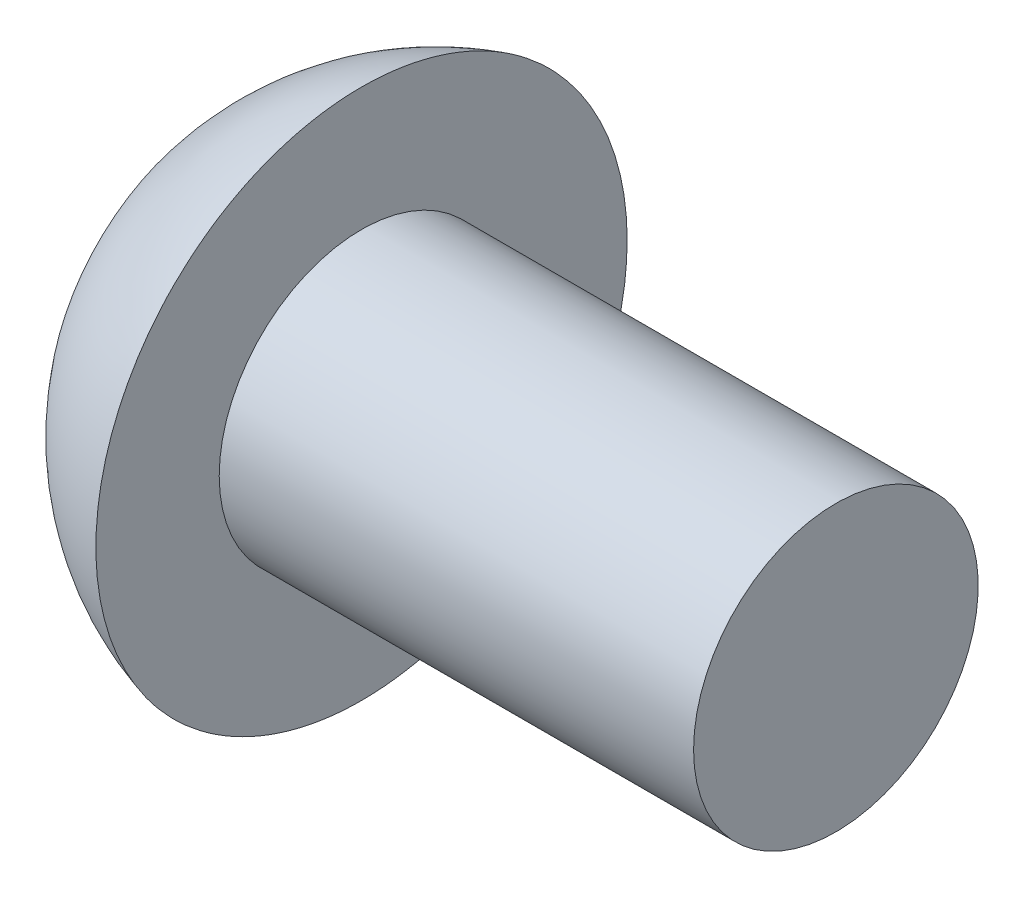
ISO-10303-21;
HEADER;
FILE_DESCRIPTION(('STEP AP214'),'2;1');
FILE_NAME('part.step','',(''),(''),'','','');
FILE_SCHEMA(('AUTOMOTIVE_DESIGN { 1 0 10303 214 1 1 1 1 }'));
ENDSEC;
DATA;
#1=APPLICATION_CONTEXT('core data for automotive mechanical design processes');
#2=APPLICATION_PROTOCOL_DEFINITION('international standard','automotive_design',2000,#1);
#3=PRODUCT_CONTEXT('',#1,'mechanical');
#4=PRODUCT('Part','Part','',(#3));
#5=PRODUCT_RELATED_PRODUCT_CATEGORY('part','',(#4));
#6=PRODUCT_DEFINITION_FORMATION('','',#4);
#7=PRODUCT_DEFINITION_CONTEXT('part definition',#1,'design');
#8=PRODUCT_DEFINITION('design','',#6,#7);
#9=PRODUCT_DEFINITION_SHAPE('','',#8);
#10=(LENGTH_UNIT() NAMED_UNIT(*) SI_UNIT(.MILLI.,.METRE.));
#11=(NAMED_UNIT(*) PLANE_ANGLE_UNIT() SI_UNIT($,.RADIAN.));
#12=(NAMED_UNIT(*) SI_UNIT($,.STERADIAN.) SOLID_ANGLE_UNIT());
#13=UNCERTAINTY_MEASURE_WITH_UNIT(LENGTH_MEASURE(1.E-05),#10,'distance_accuracy_value','');
#14=(GEOMETRIC_REPRESENTATION_CONTEXT(3) GLOBAL_UNCERTAINTY_ASSIGNED_CONTEXT((#13)) GLOBAL_UNIT_ASSIGNED_CONTEXT((#10,
#11,#12)) REPRESENTATION_CONTEXT('',''));
#15=CARTESIAN_POINT('',(0.,0.,0.));
#16=DIRECTION('',(0.,0.,1.));
#17=DIRECTION('',(1.,0.,0.));
#18=AXIS2_PLACEMENT_3D('',#15,#16,#17);
#19=CARTESIAN_POINT('',(1.3,0.,0.));
#20=DIRECTION('',(-1.,0.,0.));
#21=DIRECTION('',(0.,0.,1.));
#22=AXIS2_PLACEMENT_3D('',#19,#20,#21);
#23=PLANE('',#22);
#24=DIRECTION('',(0.,0.866025403784439,-0.5));
#25=VECTOR('',#24,1.);
#26=CARTESIAN_POINT('',(1.3,0.,-1.15470053837925));
#27=LINE('',#26,#25);
#28=CARTESIAN_POINT('',(1.3,0.,-1.15470053837925));
#29=VERTEX_POINT('',#28);
#30=CARTESIAN_POINT('',(1.3,-1.,-0.577350269189626));
#31=VERTEX_POINT('',#30);
#32=EDGE_CURVE('E95',#29,#31,#27,.F.);
#33=ORIENTED_EDGE('',*,*,#32,.T.);
#34=DIRECTION('',(0.,0.,-1.));
#35=VECTOR('',#34,1.);
#36=CARTESIAN_POINT('',(1.3,-1.,-0.577350269189626));
#37=LINE('',#36,#35);
#38=CARTESIAN_POINT('',(1.3,-1.,0.577350269189626));
#39=VERTEX_POINT('',#38);
#40=EDGE_CURVE('E142',#31,#39,#37,.F.);
#41=ORIENTED_EDGE('',*,*,#40,.T.);
#42=DIRECTION('',(0.,-0.866025403784439,-0.5));
#43=VECTOR('',#42,1.);
#44=CARTESIAN_POINT('',(1.3,-1.,0.577350269189626));
#45=LINE('',#44,#43);
#46=CARTESIAN_POINT('',(1.3,0.,1.15470053837925));
#47=VERTEX_POINT('',#46);
#48=EDGE_CURVE('E137',#39,#47,#45,.F.);
#49=ORIENTED_EDGE('',*,*,#48,.T.);
#50=DIRECTION('',(0.,-0.866025403784439,0.5));
#51=VECTOR('',#50,1.);
#52=CARTESIAN_POINT('',(1.3,0.,1.15470053837925));
#53=LINE('',#52,#51);
#54=CARTESIAN_POINT('',(1.3,1.,0.577350269189625));
#55=VERTEX_POINT('',#54);
#56=EDGE_CURVE('E78',#47,#55,#53,.F.);
#57=ORIENTED_EDGE('',*,*,#56,.T.);
#58=DIRECTION('',(0.,0.,1.));
#59=VECTOR('',#58,1.);
#60=CARTESIAN_POINT('',(1.3,1.,0.577350269189625));
#61=LINE('',#60,#59);
#62=CARTESIAN_POINT('',(1.3,1.,-0.577350269189626));
#63=VERTEX_POINT('',#62);
#64=EDGE_CURVE('E75',#55,#63,#61,.F.);
#65=ORIENTED_EDGE('',*,*,#64,.T.);
#66=DIRECTION('',(0.,0.866025403784439,0.5));
#67=VECTOR('',#66,1.);
#68=CARTESIAN_POINT('',(1.3,1.,-0.577350269189626));
#69=LINE('',#68,#67);
#70=EDGE_CURVE('E72',#63,#29,#69,.F.);
#71=ORIENTED_EDGE('',*,*,#70,.T.);
#72=EDGE_LOOP('',(#33,#41,#49,#57,#65,#71));
#73=FACE_BOUND('',#72,.T.);
#74=ADVANCED_FACE('F17',(#73),#23,.T.);
#75=CARTESIAN_POINT('',(1.3,1.,0.577350269189625));
#76=DIRECTION('',(0.,1.,0.));
#77=DIRECTION('',(0.,0.,1.));
#78=AXIS2_PLACEMENT_3D('',#75,#76,#77);
#79=PLANE('',#78);
#80=DIRECTION('',(1.,0.,0.));
#81=VECTOR('',#80,1.);
#82=CARTESIAN_POINT('',(1.3,1.,-0.577350269189626));
#83=LINE('',#82,#81);
#84=CARTESIAN_POINT('',(0.,1.,-0.577350269189626));
#85=VERTEX_POINT('',#84);
#86=EDGE_CURVE('E81',#85,#63,#83,.T.);
#87=ORIENTED_EDGE('',*,*,#86,.T.);
#88=ORIENTED_EDGE('',*,*,#64,.F.);
#89=DIRECTION('',(1.,0.,0.));
#90=VECTOR('',#89,1.);
#91=CARTESIAN_POINT('',(1.3,1.,0.577350269189625));
#92=LINE('',#91,#90);
#93=CARTESIAN_POINT('',(0.,1.,0.577350269189625));
#94=VERTEX_POINT('',#93);
#95=EDGE_CURVE('E132',#55,#94,#92,.F.);
#96=ORIENTED_EDGE('',*,*,#95,.T.);
#97=DIRECTION('',(0.,0.,-1.));
#98=VECTOR('',#97,1.);
#99=CARTESIAN_POINT('',(0.,1.,0.));
#100=LINE('',#99,#98);
#101=EDGE_CURVE('E86',#94,#85,#100,.T.);
#102=ORIENTED_EDGE('',*,*,#101,.T.);
#103=EDGE_LOOP('',(#87,#88,#96,#102));
#104=FACE_BOUND('',#103,.T.);
#105=ADVANCED_FACE('F84',(#104),#79,.F.);
#106=CARTESIAN_POINT('',(1.3,1.,-0.577350269189626));
#107=DIRECTION('',(0.,0.5,-0.866025403784439));
#108=DIRECTION('',(0.,0.866025403784439,0.5));
#109=AXIS2_PLACEMENT_3D('',#106,#107,#108);
#110=PLANE('',#109);
#111=DIRECTION('',(1.,0.,0.));
#112=VECTOR('',#111,1.);
#113=CARTESIAN_POINT('',(1.3,0.,-1.15470053837925));
#114=LINE('',#113,#112);
#115=CARTESIAN_POINT('',(0.,0.,-1.15470053837925));
#116=VERTEX_POINT('',#115);
#117=EDGE_CURVE('E92',#116,#29,#114,.T.);
#118=ORIENTED_EDGE('',*,*,#117,.T.);
#119=ORIENTED_EDGE('',*,*,#70,.F.);
#120=ORIENTED_EDGE('',*,*,#86,.F.);
#121=DIRECTION('',(0.,-0.866025403784439,-0.5));
#122=VECTOR('',#121,1.);
#123=CARTESIAN_POINT('',(0.,1.,-0.577350269189626));
#124=LINE('',#123,#122);
#125=EDGE_CURVE('E129',#85,#116,#124,.T.);
#126=ORIENTED_EDGE('',*,*,#125,.T.);
#127=EDGE_LOOP('',(#118,#119,#120,#126));
#128=FACE_BOUND('',#127,.T.);
#129=ADVANCED_FACE('F90',(#128),#110,.F.);
#130=CARTESIAN_POINT('',(1.3,0.,-1.15470053837925));
#131=DIRECTION('',(0.,-0.5,-0.866025403784439));
#132=DIRECTION('',(0.,0.866025403784439,-0.5));
#133=AXIS2_PLACEMENT_3D('',#130,#131,#132);
#134=PLANE('',#133);
#135=DIRECTION('',(1.,0.,0.));
#136=VECTOR('',#135,1.);
#137=CARTESIAN_POINT('',(1.3,-1.,-0.577350269189626));
#138=LINE('',#137,#136);
#139=CARTESIAN_POINT('',(0.,-1.,-0.577350269189626));
#140=VERTEX_POINT('',#139);
#141=EDGE_CURVE('E144',#140,#31,#138,.T.);
#142=ORIENTED_EDGE('',*,*,#141,.T.);
#143=ORIENTED_EDGE('',*,*,#32,.F.);
#144=ORIENTED_EDGE('',*,*,#117,.F.);
#145=DIRECTION('',(0.,-0.866025403784439,0.5));
#146=VECTOR('',#145,1.);
#147=CARTESIAN_POINT('',(0.,0.,-1.15470053837925));
#148=LINE('',#147,#146);
#149=EDGE_CURVE('E127',#116,#140,#148,.T.);
#150=ORIENTED_EDGE('',*,*,#149,.T.);
#151=EDGE_LOOP('',(#142,#143,#144,#150));
#152=FACE_BOUND('',#151,.T.);
#153=ADVANCED_FACE('F149',(#152),#134,.F.);
#154=CARTESIAN_POINT('',(1.3,-1.,-0.577350269189626));
#155=DIRECTION('',(0.,-1.,0.));
#156=DIRECTION('',(0.,0.,-1.));
#157=AXIS2_PLACEMENT_3D('',#154,#155,#156);
#158=PLANE('',#157);
#159=DIRECTION('',(1.,0.,0.));
#160=VECTOR('',#159,1.);
#161=CARTESIAN_POINT('',(1.3,-1.,0.577350269189626));
#162=LINE('',#161,#160);
#163=CARTESIAN_POINT('',(0.,-1.,0.577350269189626));
#164=VERTEX_POINT('',#163);
#165=EDGE_CURVE('E139',#164,#39,#162,.T.);
#166=ORIENTED_EDGE('',*,*,#165,.T.);
#167=ORIENTED_EDGE('',*,*,#40,.F.);
#168=ORIENTED_EDGE('',*,*,#141,.F.);
#169=DIRECTION('',(0.,0.,-1.));
#170=VECTOR('',#169,1.);
#171=CARTESIAN_POINT('',(0.,-1.,0.));
#172=LINE('',#171,#170);
#173=EDGE_CURVE('E125',#140,#164,#172,.F.);
#174=ORIENTED_EDGE('',*,*,#173,.T.);
#175=EDGE_LOOP('',(#166,#167,#168,#174));
#176=FACE_BOUND('',#175,.T.);
#177=ADVANCED_FACE('F153',(#176),#158,.F.);
#178=CARTESIAN_POINT('',(1.3,-1.,0.577350269189626));
#179=DIRECTION('',(0.,-0.5,0.866025403784439));
#180=DIRECTION('',(0.,-0.866025403784439,-0.5));
#181=AXIS2_PLACEMENT_3D('',#178,#179,#180);
#182=PLANE('',#181);
#183=DIRECTION('',(1.,0.,0.));
#184=VECTOR('',#183,1.);
#185=CARTESIAN_POINT('',(1.3,0.,1.15470053837925));
#186=LINE('',#185,#184);
#187=CARTESIAN_POINT('',(0.,0.,1.15470053837925));
#188=VERTEX_POINT('',#187);
#189=EDGE_CURVE('E135',#188,#47,#186,.T.);
#190=ORIENTED_EDGE('',*,*,#189,.T.);
#191=ORIENTED_EDGE('',*,*,#48,.F.);
#192=ORIENTED_EDGE('',*,*,#165,.F.);
#193=DIRECTION('',(0.,0.866025403784439,0.5));
#194=VECTOR('',#193,1.);
#195=CARTESIAN_POINT('',(0.,-1.,0.577350269189626));
#196=LINE('',#195,#194);
#197=EDGE_CURVE('E39',#164,#188,#196,.T.);
#198=ORIENTED_EDGE('',*,*,#197,.T.);
#199=EDGE_LOOP('',(#190,#191,#192,#198));
#200=FACE_BOUND('',#199,.T.);
#201=ADVANCED_FACE('F155',(#200),#182,.F.);
#202=CARTESIAN_POINT('',(1.3,0.,1.15470053837925));
#203=DIRECTION('',(0.,0.5,0.866025403784439));
#204=DIRECTION('',(0.,-0.866025403784439,0.5));
#205=AXIS2_PLACEMENT_3D('',#202,#203,#204);
#206=PLANE('',#205);
#207=ORIENTED_EDGE('',*,*,#95,.F.);
#208=ORIENTED_EDGE('',*,*,#56,.F.);
#209=ORIENTED_EDGE('',*,*,#189,.F.);
#210=DIRECTION('',(0.,0.866025403784438,-0.5));
#211=VECTOR('',#210,1.);
#212=CARTESIAN_POINT('',(0.,0.,1.15470053837925));
#213=LINE('',#212,#211);
#214=EDGE_CURVE('E121',#188,#94,#213,.T.);
#215=ORIENTED_EDGE('',*,*,#214,.T.);
#216=EDGE_LOOP('',(#207,#208,#209,#215));
#217=FACE_BOUND('',#216,.T.);
#218=ADVANCED_FACE('F158',(#217),#206,.F.);
#219=CARTESIAN_POINT('',(0.,0.,0.));
#220=DIRECTION('',(1.,0.,0.));
#221=DIRECTION('',(0.,0.,-1.));
#222=AXIS2_PLACEMENT_3D('',#219,#220,#221);
#223=PLANE('',#222);
#224=CARTESIAN_POINT('',(0.,-1.8,0.));
#225=CARTESIAN_POINT('',(0.,-1.79999969693813,-0.0505383553463636));
#226=CARTESIAN_POINT('',(0.,-1.79786965821117,-0.101085998847833));
#227=CARTESIAN_POINT('',(0.,-1.78936335708246,-0.201831968349741));
#228=CARTESIAN_POINT('',(1.51071546462001E-13,-1.78298584106246,-0.252030186798318));
#229=CARTESIAN_POINT('',(-1.51311933718999E-13,-1.76601326021542,-0.35179543440894));
#230=CARTESIAN_POINT('',(-5.6574903691244E-13,-1.7554115005106,-0.401361332113267));
#231=CARTESIAN_POINT('',(5.66209102950636E-13,-1.73006357821317,-0.4994513470748));
#232=CARTESIAN_POINT('',(2.11419916519631E-12,-1.7153140524109,-0.547974584380645));
#233=CARTESIAN_POINT('',(3.7989553682124E-12,-1.66504737561974,-0.691252996354969));
#234=CARTESIAN_POINT('',(9.97957659202798E-13,-1.62347083872426,-0.783957995374269));
#235=CARTESIAN_POINT('',(-9.97995599810074E-13,-1.5253242715079,-0.961060444041289));
#236=CARTESIAN_POINT('',(-1.92814050339862E-13,-1.46875367122068,-1.0454575777165));
#237=CARTESIAN_POINT('',(0.,-1.37393237862705,-1.1639935576829));
#238=CARTESIAN_POINT('',(0.,-1.34063934533778,-1.20218459533929));
#239=CARTESIAN_POINT('',(0.,-1.27099181665424,-1.27559317409802));
#240=CARTESIAN_POINT('',(0.,-1.2346403039193,-1.31081354659702));
#241=CARTESIAN_POINT('',(1.49397313255741E-13,-1.12128865477494,-1.41171053074979));
#242=CARTESIAN_POINT('',(7.2255174093582E-13,-1.03997085608677,-1.47264864886824));
#243=CARTESIAN_POINT('',(7.20738225274102E-13,-0.868302977752408,-1.57997169667932));
#244=CARTESIAN_POINT('',(1.45813580276399E-13,-0.777953238856439,-1.62635717512994));
#245=CARTESIAN_POINT('',(-1.45812022887226E-13,-0.590738654674472,-1.70330985037171));
#246=CARTESIAN_POINT('',(1.37477852594083E-13,-0.493873878984592,-1.73387721610768));
#247=CARTESIAN_POINT('',(2.30283772122708E-13,-0.296389602022536,-1.77831350061168));
#248=CARTESIAN_POINT('',(0.,-0.195770080701387,-1.79218233020245));
#249=CARTESIAN_POINT('',(0.,0.00636923610669175,-1.80283190065489));
#250=CARTESIAN_POINT('',(0.,0.10788903159362,-1.79961264151658));
#251=CARTESIAN_POINT('',(0.,0.308949283786903,-1.77617340058004));
#252=CARTESIAN_POINT('',(0.,0.408489751060768,-1.75595350957209));
#253=CARTESIAN_POINT('',(0.,0.602753886185803,-1.69909877747923));
#254=CARTESIAN_POINT('',(0.,0.69747750257834,-1.6624637610718));
#255=CARTESIAN_POINT('',(0.,0.879472223548245,-1.5737731833174));
#256=CARTESIAN_POINT('',(0.,0.96674304692356,-1.52171704044529));
#257=CARTESIAN_POINT('',(0.,1.09006914068348,-1.43328925989624));
#258=CARTESIAN_POINT('',(0.,1.12992026465015,-1.40208357074052));
#259=CARTESIAN_POINT('',(0.,1.20689578170788,-1.33639972599312));
#260=CARTESIAN_POINT('',(0.,1.24401750616591,-1.30191844127035));
#261=CARTESIAN_POINT('',(1.43656520355628E-13,1.35076927785449,-1.19400219913293));
#262=CARTESIAN_POINT('',(0.,1.41589490317864,-1.11601654714749));
#263=CARTESIAN_POINT('',(0.,1.53210752784414,-0.950207464620376));
#264=CARTESIAN_POINT('',(0.,1.58319506079509,-0.86238440819234));
#265=CARTESIAN_POINT('',(0.,1.64823872656556,-0.725181042064781));
#266=CARTESIAN_POINT('',(0.,1.66800527485629,-0.67847626031049));
#267=CARTESIAN_POINT('',(0.,1.70351987444946,-0.583592745326409));
#268=CARTESIAN_POINT('',(0.,1.71927117788053,-0.535415240572516));
#269=CARTESIAN_POINT('',(0.,1.74663282949914,-0.437985711413424));
#270=CARTESIAN_POINT('',(0.,1.75824971661208,-0.388735515679737));
#271=CARTESIAN_POINT('',(0.,1.77729500833267,-0.289441082839439));
#272=CARTESIAN_POINT('',(0.,1.78472464831743,-0.239397084415694));
#273=CARTESIAN_POINT('',(0.,1.79335428483933,-0.157729601792055));
#274=CARTESIAN_POINT('',(0.,1.79584563928913,-0.126236872827486));
#275=CARTESIAN_POINT('',(0.,1.79916859156829,-0.0631639717658366));
#276=CARTESIAN_POINT('',(0.,1.80000018939764,-0.0315837996687572));
#277=CARTESIAN_POINT('',(0.,1.79999969693813,0.0505383553463631));
#278=CARTESIAN_POINT('',(0.,1.79786965821117,0.101085998847833));
#279=CARTESIAN_POINT('',(0.,1.78936335708246,0.201831968349741));
#280=CARTESIAN_POINT('',(1.51230046268288E-13,1.78298584106246,0.252030186798317));
#281=CARTESIAN_POINT('',(-1.51470685732498E-13,1.76601326021542,0.35179543440894));
#282=CARTESIAN_POINT('',(-5.65748370397587E-13,1.7554115005106,0.401361332113267));
#283=CARTESIAN_POINT('',(5.66208435893774E-13,1.73006357821317,0.4994513470748));
#284=CARTESIAN_POINT('',(2.11403748557181E-12,1.7153140524109,0.547974584380644));
#285=CARTESIAN_POINT('',(3.79927795675373E-12,1.66504737561974,0.691252996354969));
#286=CARTESIAN_POINT('',(9.99887459444341E-13,1.62347083872427,0.783957995374269));
#287=CARTESIAN_POINT('',(-9.99925473419254E-13,1.5253242715079,0.961060444041288));
#288=CARTESIAN_POINT('',(-2.00211078447118E-13,1.46875367122068,1.04545757771649));
#289=CARTESIAN_POINT('',(0.,1.37393237862705,1.1639935576829));
#290=CARTESIAN_POINT('',(0.,1.34063934533778,1.20218459533929));
#291=CARTESIAN_POINT('',(0.,1.27099181665424,1.27559317409802));
#292=CARTESIAN_POINT('',(0.,1.2346403039193,1.31081354659702));
#293=CARTESIAN_POINT('',(1.48899528940263E-13,1.12128865477494,1.41171053074979));
#294=CARTESIAN_POINT('',(7.23912342890468E-13,1.03997085608677,1.47264864886824));
#295=CARTESIAN_POINT('',(7.22847056162156E-13,0.868302977752408,1.57997169667932));
#296=CARTESIAN_POINT('',(1.46812365777827E-13,0.777953238856439,1.62635717512994));
#297=CARTESIAN_POINT('',(-1.46810797720938E-13,0.590738654674473,1.70330985037171));
#298=CARTESIAN_POINT('',(1.35591560435206E-13,0.493873878984592,1.73387721610768));
#299=CARTESIAN_POINT('',(2.28700618139069E-13,0.296389602022537,1.77831350061168));
#300=CARTESIAN_POINT('',(0.,0.195770080701387,1.79218233020245));
#301=CARTESIAN_POINT('',(0.,-0.00636923610669051,1.8028319006549));
#302=CARTESIAN_POINT('',(0.,-0.107889031593619,1.79961264151658));
#303=CARTESIAN_POINT('',(0.,-0.308949283786901,1.77617340058004));
#304=CARTESIAN_POINT('',(0.,-0.408489751060766,1.75595350957209));
#305=CARTESIAN_POINT('',(0.,-0.602753886185801,1.69909877747923));
#306=CARTESIAN_POINT('',(0.,-0.697477502578339,1.6624637610718));
#307=CARTESIAN_POINT('',(0.,-0.879472223548244,1.5737731833174));
#308=CARTESIAN_POINT('',(0.,-0.966743046923559,1.52171704044529));
#309=CARTESIAN_POINT('',(0.,-1.09006914068348,1.43328925989624));
#310=CARTESIAN_POINT('',(0.,-1.12992026465015,1.40208357074052));
#311=CARTESIAN_POINT('',(0.,-1.20689578170787,1.33639972599313));
#312=CARTESIAN_POINT('',(0.,-1.24401750616591,1.30191844127035));
#313=CARTESIAN_POINT('',(1.43684743749562E-13,-1.35076927785449,1.19400219913293));
#314=CARTESIAN_POINT('',(0.,-1.41589490317864,1.11601654714749));
#315=CARTESIAN_POINT('',(0.,-1.53210752784414,0.950207464620378));
#316=CARTESIAN_POINT('',(0.,-1.58319506079509,0.862384408192342));
#317=CARTESIAN_POINT('',(0.,-1.64823872656556,0.725181042064782));
#318=CARTESIAN_POINT('',(0.,-1.66800527485629,0.678476260310492));
#319=CARTESIAN_POINT('',(0.,-1.70351987444946,0.58359274532641));
#320=CARTESIAN_POINT('',(0.,-1.71927117788053,0.535415240572518));
#321=CARTESIAN_POINT('',(0.,-1.74663282949914,0.437985711413426));
#322=CARTESIAN_POINT('',(0.,-1.75824971661208,0.388735515679738));
#323=CARTESIAN_POINT('',(0.,-1.77729500833267,0.28944108283944));
#324=CARTESIAN_POINT('',(0.,-1.78472464831743,0.239397084415696));
#325=CARTESIAN_POINT('',(0.,-1.79335428483933,0.157729601792057));
#326=CARTESIAN_POINT('',(0.,-1.79584563928913,0.126236872827486));
#327=CARTESIAN_POINT('',(0.,-1.79916859156829,0.0631639717658366));
#328=CARTESIAN_POINT('',(0.,-1.80000018939764,0.031583799668757));
#329=CARTESIAN_POINT('',(0.,-1.8,0.));
#330=B_SPLINE_CURVE_WITH_KNOTS('',3,(#224,#225,#226,#227,#228,#229,#230,#231,#232,#233,#234,
#235,#236,#237,#238,#239,#240,#241,#242,#243,#244,#245,#246,#247,#248,#249,#250,#251,#252,#253,
#254,#255,#256,#257,#258,#259,#260,#261,#262,#263,#264,#265,#266,#267,#268,#269,#270,#271,#272,
#273,#274,#275,#276,#277,#278,#279,#280,#281,#282,#283,#284,#285,#286,#287,#288,#289,#290,#291,
#292,#293,#294,#295,#296,#297,#298,#299,#300,#301,#302,#303,#304,#305,#306,#307,#308,#309,#310,
#311,#312,#313,#314,#315,#316,#317,#318,#319,#320,#321,#322,#323,#324,#325,#326,#327,#328,#329),
.UNSPECIFIED.,.T.,.F.,(4,2,2,2,2,2,2,2,2,2,2,2,2,2,2,2,2,2,2,2,2,2,2,2,2,2,2,2,2,2,2,2,2,2,2,2,
2,2,2,2,2,2,2,2,2,2,2,2,2,2,2,2,4),(0.,0.151585989710196,0.303216738983041,0.455088765324585,
0.6070842937084,0.910350805750165,1.21362884745506,1.36546657207417,1.51715790225758,
1.82044323652332,2.12371713298388,2.42698779027096,2.73026006714468,3.03353234401834,
3.33680300130515,3.6400768977656,3.94336223203168,4.09505356221516,4.24689128683427,
4.55016932853894,4.8534358405808,5.00543136896507,5.15730339530697,5.30893414458,
5.46052013429044,5.55525336212866,5.64998658996691,5.8015725796771,5.95320332894995,
6.10507535529149,6.25707088367531,6.56033739571707,6.86361543742197,7.01545316204107,
7.16714449222448,7.47042982649022,7.77370372295079,8.07697438023786,8.38024665711158,
8.68351893398524,8.98678959127205,9.29006348773251,9.59334882199858,9.74504015218206,
9.89687787680118,10.2001559185058,10.5034224305477,10.655417958932,10.8072899852739,
10.9589207345469,11.1105067242574,11.2052399520956,11.2999731799338),.UNSPECIFIED.);
#331=CARTESIAN_POINT('',(0.,-1.8,0.));
#332=VERTEX_POINT('',#331);
#333=EDGE_CURVE('E20',#332,#332,#330,.T.);
#334=ORIENTED_EDGE('',*,*,#333,.F.);
#335=EDGE_LOOP('',(#334));
#336=FACE_BOUND('',#335,.T.);
#337=ORIENTED_EDGE('',*,*,#197,.F.);
#338=ORIENTED_EDGE('',*,*,#173,.F.);
#339=ORIENTED_EDGE('',*,*,#149,.F.);
#340=ORIENTED_EDGE('',*,*,#125,.F.);
#341=ORIENTED_EDGE('',*,*,#101,.F.);
#342=ORIENTED_EDGE('',*,*,#214,.F.);
#343=EDGE_LOOP('',(#337,#338,#339,#340,#341,#342));
#344=FACE_BOUND('',#343,.T.);
#345=ADVANCED_FACE('F114',(#336,#344),#223,.F.);
#346=CARTESIAN_POINT('',(2.28333333333333,0.,0.));
#347=DIRECTION('',(0.,1.,0.));
#348=DIRECTION('',(1.,0.,0.));
#349=AXIS2_PLACEMENT_3D('',#346,#347,#348);
#350=SPHERICAL_SURFACE('',#349,2.90750943439761);
#351=ORIENTED_EDGE('',*,*,#333,.T.);
#352=EDGE_LOOP('',(#351));
#353=FACE_BOUND('',#352,.T.);
#354=CARTESIAN_POINT('',(1.5,2.8,0.));
#355=CARTESIAN_POINT('',(1.5,2.80000058114663,-0.097602902906246));
#356=CARTESIAN_POINT('',(1.5,2.79489033321137,-0.195197225793099));
#357=CARTESIAN_POINT('',(1.5,2.77451565330272,-0.389368402876138));
#358=CARTESIAN_POINT('',(1.5,2.75924432689463,-0.485944520978123));
#359=CARTESIAN_POINT('',(1.5,2.70627858731672,-0.735356657485282));
#360=CARTESIAN_POINT('',(1.5,2.66058825775473,-0.886570466076757));
#361=CARTESIAN_POINT('',(1.5,2.54443496530946,-1.17927883826553));
#362=CARTESIAN_POINT('',(1.5,2.47394598727788,-1.32076300787352));
#363=CARTESIAN_POINT('',(1.5,2.31023409393156,-1.5898419060271));
#364=CARTESIAN_POINT('',(1.5,2.21702056371508,-1.71744233708582));
#365=CARTESIAN_POINT('',(1.5,2.01051665662983,-1.95514926157889));
#366=CARTESIAN_POINT('',(1.5,1.89723083380139,-2.06525971244938));
#367=CARTESIAN_POINT('',(1.5,1.65377108245464,-2.26491180732828));
#368=CARTESIAN_POINT('',(1.5,1.52359556754626,-2.35445151700685));
#369=CARTESIAN_POINT('',(1.5,1.2500547452375,-2.51040859878638));
#370=CARTESIAN_POINT('',(1.5,1.1066889282367,-2.57682507705875));
#371=CARTESIAN_POINT('',(1.5,0.810844291441427,-2.68464490303648));
#372=CARTESIAN_POINT('',(1.5,0.6583656348651,-2.72604869859128));
#373=CARTESIAN_POINT('',(1.5,0.348621867363058,-2.78266949830994));
#374=CARTESIAN_POINT('',(1.5,0.191356770024623,-2.79788657680303));
#375=CARTESIAN_POINT('',(1.5,-0.123496096015708,-2.80170224104092));
#376=CARTESIAN_POINT('',(1.5,-0.281083864890645,-2.79030081250716));
#377=CARTESIAN_POINT('',(1.5,-0.592108819054531,-2.74120301008156));
#378=CARTESIAN_POINT('',(1.5,-0.745545997014651,-2.70350658976297));
#379=CARTESIAN_POINT('',(1.5,-1.04391584692778,-2.6028882607058));
#380=CARTESIAN_POINT('',(1.5,-1.18884840460742,-2.53996601310625));
#381=CARTESIAN_POINT('',(1.5,-1.46608850320062,-2.39068404738938));
#382=CARTESIAN_POINT('',(1.5,-1.59839640547873,-2.30432500039254));
#383=CARTESIAN_POINT('',(1.5,-1.84662736593538,-2.11062813801582));
#384=CARTESIAN_POINT('',(1.5,-1.96255156458538,-2.00329178410926));
#385=CARTESIAN_POINT('',(1.5,-2.1747542244558,-1.77065850816234));
#386=CARTESIAN_POINT('',(1.5,-2.27102938322741,-1.64535857296605));
#387=CARTESIAN_POINT('',(1.5,-2.44120016914855,-1.38034674222735));
#388=CARTESIAN_POINT('',(1.5,-2.51508899178783,-1.24063048198967));
#389=CARTESIAN_POINT('',(1.5,-2.63830716797482,-0.950832062564711));
#390=CARTESIAN_POINT('',(1.5,-2.68765551021545,-0.800758020642758));
#391=CARTESIAN_POINT('',(1.5,-2.74927114196675,-0.54167924182637));
#392=CARTESIAN_POINT('',(1.5,-2.7682728701565,-0.434222541732076));
#393=CARTESIAN_POINT('',(1.5,-2.79363458299388,-0.217839951954246));
#394=CARTESIAN_POINT('',(1.5,-2.79999935150113,-0.108914633959985));
#395=CARTESIAN_POINT('',(1.5,-2.80000058114663,0.0976029029062455));
#396=CARTESIAN_POINT('',(1.5,-2.79489033321137,0.195197225793099));
#397=CARTESIAN_POINT('',(1.5,-2.77451565330272,0.389368402876137));
#398=CARTESIAN_POINT('',(1.5,-2.75924432689463,0.485944520978123));
#399=CARTESIAN_POINT('',(1.5,-2.70627858731672,0.735356657485282));
#400=CARTESIAN_POINT('',(1.5,-2.66058825775473,0.886570466076757));
#401=CARTESIAN_POINT('',(1.5,-2.54443496530946,1.17927883826553));
#402=CARTESIAN_POINT('',(1.5,-2.47394598727788,1.32076300787352));
#403=CARTESIAN_POINT('',(1.5,-2.31023409393156,1.5898419060271));
#404=CARTESIAN_POINT('',(1.5,-2.21702056371508,1.71744233708582));
#405=CARTESIAN_POINT('',(1.5,-2.01051665662983,1.95514926157889));
#406=CARTESIAN_POINT('',(1.5,-1.89723083380139,2.06525971244938));
#407=CARTESIAN_POINT('',(1.5,-1.65377108245464,2.26491180732828));
#408=CARTESIAN_POINT('',(1.5,-1.52359556754626,2.35445151700685));
#409=CARTESIAN_POINT('',(1.5,-1.2500547452375,2.51040859878638));
#410=CARTESIAN_POINT('',(1.5,-1.1066889282367,2.57682507705875));
#411=CARTESIAN_POINT('',(1.5,-0.810844291441426,2.68464490303648));
#412=CARTESIAN_POINT('',(1.5,-0.6583656348651,2.72604869859128));
#413=CARTESIAN_POINT('',(1.5,-0.348621867363058,2.78266949830994));
#414=CARTESIAN_POINT('',(1.5,-0.191356770024623,2.79788657680303));
#415=CARTESIAN_POINT('',(1.5,0.123496096015708,2.80170224104092));
#416=CARTESIAN_POINT('',(1.5,0.281083864890644,2.79030081250716));
#417=CARTESIAN_POINT('',(1.5,0.592108819054531,2.74120301008156));
#418=CARTESIAN_POINT('',(1.5,0.745545997014651,2.70350658976297));
#419=CARTESIAN_POINT('',(1.5,1.04391584692778,2.6028882607058));
#420=CARTESIAN_POINT('',(1.5,1.18884840460742,2.53996601310625));
#421=CARTESIAN_POINT('',(1.5,1.46608850320062,2.39068404738938));
#422=CARTESIAN_POINT('',(1.5,1.59839640547873,2.30432500039254));
#423=CARTESIAN_POINT('',(1.5,1.84662736593538,2.11062813801582));
#424=CARTESIAN_POINT('',(1.5,1.96255156458538,2.00329178410926));
#425=CARTESIAN_POINT('',(1.5,2.1747542244558,1.77065850816235));
#426=CARTESIAN_POINT('',(1.5,2.27102938322741,1.64535857296605));
#427=CARTESIAN_POINT('',(1.5,2.44120016914855,1.38034674222735));
#428=CARTESIAN_POINT('',(1.5,2.51508899178783,1.24063048198967));
#429=CARTESIAN_POINT('',(1.5,2.63830716797482,0.950832062564712));
#430=CARTESIAN_POINT('',(1.5,2.68765551021545,0.800758020642758));
#431=CARTESIAN_POINT('',(1.5,2.74927114196675,0.54167924182637));
#432=CARTESIAN_POINT('',(1.5,2.7682728701565,0.434222541732076));
#433=CARTESIAN_POINT('',(1.5,2.79363458299388,0.217839951954245));
#434=CARTESIAN_POINT('',(1.5,2.79999935150113,0.108914633959985));
#435=CARTESIAN_POINT('',(1.5,2.8,0.));
#436=B_SPLINE_CURVE_WITH_KNOTS('',3,(#354,#355,#356,#357,#358,#359,#360,#361,#362,#363,#364,
#365,#366,#367,#368,#369,#370,#371,#372,#373,#374,#375,#376,#377,#378,#379,#380,#381,#382,#383,
#384,#385,#386,#387,#388,#389,#390,#391,#392,#393,#394,#395,#396,#397,#398,#399,#400,#401,#402,
#403,#404,#405,#406,#407,#408,#409,#410,#411,#412,#413,#414,#415,#416,#417,#418,#419,#420,#421,
#422,#423,#424,#425,#426,#427,#428,#429,#430,#431,#432,#433,#434,#435),.UNSPECIFIED.,.T.,.F.,(4,
2,2,2,2,2,2,2,2,2,2,2,2,2,2,2,2,2,2,2,2,2,2,2,2,2,2,2,2,2,2,2,2,2,2,2,2,2,2,2,4),(0.,
0.292649740000539,0.58549824973262,1.05700706396217,1.52901199916255,2.00082232852149,
2.47252574939804,2.94427350785476,3.41603949969872,3.88779704437215,4.35955324999121,
4.83130970866732,5.30306700028442,5.77483062927493,6.24658075058338,6.71829801712137,
7.19009450084165,7.66203424742665,8.13360825067272,8.46029845584223,8.78686496525497,
9.07951470525551,9.37236321498759,9.84387202921714,10.3158769644175,10.7876872937765,
11.259390714653,11.7311384731097,12.2029044649537,12.6746620096271,13.1464182152462,
13.6181746739223,14.0899319655394,14.5616955945299,15.0334457158384,15.5051629823763,
15.9769594660966,16.4488992126816,16.9204732159277,17.2471634210972,17.5737299305099),.UNSPECIFIED.);
#437=CARTESIAN_POINT('',(1.5,2.8,0.));
#438=VERTEX_POINT('',#437);
#439=EDGE_CURVE('E100',#438,#438,#436,.T.);
#440=ORIENTED_EDGE('',*,*,#439,.T.);
#441=EDGE_LOOP('',(#440));
#442=FACE_BOUND('',#441,.T.);
#443=ADVANCED_FACE('F109',(#353,#442),#350,.T.);
#444=CARTESIAN_POINT('',(6.5,0.,0.));
#445=DIRECTION('',(-1.,0.,0.));
#446=DIRECTION('',(0.,0.,1.));
#447=AXIS2_PLACEMENT_3D('',#444,#445,#446);
#448=PLANE('',#447);
#449=CARTESIAN_POINT('',(6.5,0.,0.));
#450=DIRECTION('',(-1.,0.,0.));
#451=DIRECTION('',(0.,0.,1.));
#452=AXIS2_PLACEMENT_3D('',#449,#450,#451);
#453=CIRCLE('',#452,1.5);
#454=CARTESIAN_POINT('',(6.5,0.,1.5));
#455=VERTEX_POINT('',#454);
#456=EDGE_CURVE('E30',#455,#455,#453,.T.);
#457=ORIENTED_EDGE('',*,*,#456,.F.);
#458=EDGE_LOOP('',(#457));
#459=FACE_BOUND('',#458,.T.);
#460=ADVANCED_FACE('F113',(#459),#448,.F.);
#461=CARTESIAN_POINT('',(1.5,1.5,0.));
#462=DIRECTION('',(-1.,0.,0.));
#463=DIRECTION('',(0.,0.,1.));
#464=AXIS2_PLACEMENT_3D('',#461,#462,#463);
#465=PLANE('',#464);
#466=CARTESIAN_POINT('',(1.5,0.,0.));
#467=DIRECTION('',(-1.,0.,0.));
#468=DIRECTION('',(0.,0.,1.));
#469=AXIS2_PLACEMENT_3D('',#466,#467,#468);
#470=CIRCLE('',#469,1.5);
#471=CARTESIAN_POINT('',(1.5,0.,1.5));
#472=VERTEX_POINT('',#471);
#473=EDGE_CURVE('E11',#472,#472,#470,.F.);
#474=ORIENTED_EDGE('',*,*,#473,.F.);
#475=EDGE_LOOP('',(#474));
#476=FACE_BOUND('',#475,.T.);
#477=ORIENTED_EDGE('',*,*,#439,.F.);
#478=EDGE_LOOP('',(#477));
#479=FACE_BOUND('',#478,.T.);
#480=ADVANCED_FACE('F105',(#476,#479),#465,.F.);
#481=CARTESIAN_POINT('',(-16.5029441624365,0.,0.));
#482=DIRECTION('',(-1.,0.,0.));
#483=DIRECTION('',(0.,0.,1.));
#484=AXIS2_PLACEMENT_3D('',#481,#482,#483);
#485=CYLINDRICAL_SURFACE('',#484,1.5);
#486=ORIENTED_EDGE('',*,*,#473,.T.);
#487=EDGE_LOOP('',(#486));
#488=FACE_BOUND('',#487,.T.);
#489=ORIENTED_EDGE('',*,*,#456,.T.);
#490=EDGE_LOOP('',(#489));
#491=FACE_BOUND('',#490,.T.);
#492=ADVANCED_FACE('F167',(#488,#491),#485,.T.);
#493=CLOSED_SHELL('',(#74,#105,#129,#153,#177,#201,#218,#345,#443,#460,#480,#492));
#494=MANIFOLD_SOLID_BREP('B1',#493);
#495=ADVANCED_BREP_SHAPE_REPRESENTATION('',(#18,#494),#14);
#496=SHAPE_DEFINITION_REPRESENTATION(#9,#495);
ENDSEC;
END-ISO-10303-21;
